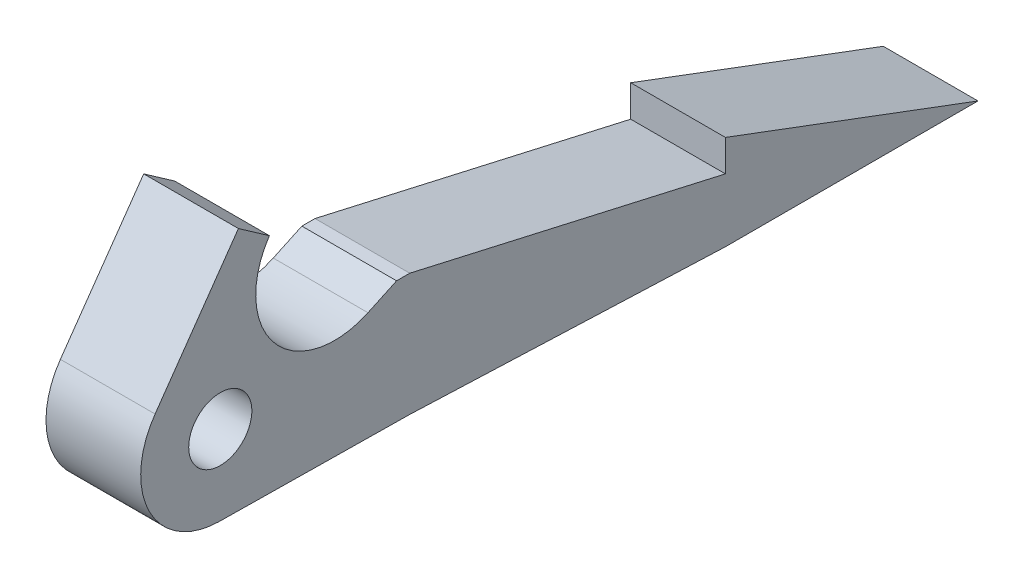
ISO-10303-21;
HEADER;
FILE_DESCRIPTION(('STEP AP214'),'2;1');
FILE_NAME('part.step','',(''),(''),'','','');
FILE_SCHEMA(('AUTOMOTIVE_DESIGN { 1 0 10303 214 1 1 1 1 }'));
ENDSEC;
DATA;
#1=APPLICATION_CONTEXT('core data for automotive mechanical design processes');
#2=APPLICATION_PROTOCOL_DEFINITION('international standard','automotive_design',2000,#1);
#3=PRODUCT_CONTEXT('',#1,'mechanical');
#4=PRODUCT('Part','Part','',(#3));
#5=PRODUCT_RELATED_PRODUCT_CATEGORY('part','',(#4));
#6=PRODUCT_DEFINITION_FORMATION('','',#4);
#7=PRODUCT_DEFINITION_CONTEXT('part definition',#1,'design');
#8=PRODUCT_DEFINITION('design','',#6,#7);
#9=PRODUCT_DEFINITION_SHAPE('','',#8);
#10=(LENGTH_UNIT() NAMED_UNIT(*) SI_UNIT(.MILLI.,.METRE.));
#11=(NAMED_UNIT(*) PLANE_ANGLE_UNIT() SI_UNIT($,.RADIAN.));
#12=(NAMED_UNIT(*) SI_UNIT($,.STERADIAN.) SOLID_ANGLE_UNIT());
#13=UNCERTAINTY_MEASURE_WITH_UNIT(LENGTH_MEASURE(1.E-05),#10,'distance_accuracy_value','');
#14=(GEOMETRIC_REPRESENTATION_CONTEXT(3) GLOBAL_UNCERTAINTY_ASSIGNED_CONTEXT((#13)) GLOBAL_UNIT_ASSIGNED_CONTEXT((#10,
#11,#12)) REPRESENTATION_CONTEXT('',''));
#15=CARTESIAN_POINT('',(0.,0.,0.));
#16=DIRECTION('',(0.,0.,1.));
#17=DIRECTION('',(1.,0.,0.));
#18=AXIS2_PLACEMENT_3D('',#15,#16,#17);
#19=CARTESIAN_POINT('',(4.7625,9.525,-176.47164647412));
#20=DIRECTION('',(1.,0.,0.));
#21=DIRECTION('',(0.,0.,-1.));
#22=AXIS2_PLACEMENT_3D('',#19,#20,#21);
#23=PLANE('',#22);
#24=CARTESIAN_POINT('',(4.7625,9.525,-176.47164647412));
#25=DIRECTION('',(1.,0.,0.));
#26=DIRECTION('',(0.,0.,-1.));
#27=AXIS2_PLACEMENT_3D('',#24,#25,#26);
#28=CIRCLE('',#27,8.001);
#29=CARTESIAN_POINT('',(4.7625,14.1141850672447,-169.917610967764));
#30=VERTEX_POINT('',#29);
#31=CARTESIAN_POINT('',(4.7625,1.52470715135464,-176.365272906379));
#32=VERTEX_POINT('',#31);
#33=EDGE_CURVE('E152',#30,#32,#28,.T.);
#34=ORIENTED_EDGE('',*,*,#33,.T.);
#35=DIRECTION('',(0.,-0.0132950340883751,-0.999911617128528));
#36=VECTOR('',#35,1.);
#37=CARTESIAN_POINT('',(4.7625,1.27000000001228,-195.521646474134));
#38=LINE('',#37,#36);
#39=CARTESIAN_POINT('',(4.7625,1.27000000001228,-195.521646474134));
#40=VERTEX_POINT('',#39);
#41=EDGE_CURVE('E99',#32,#40,#38,.T.);
#42=ORIENTED_EDGE('',*,*,#41,.T.);
#43=DIRECTION('',(0.,-0.0399680383492743,-0.999200958721773));
#44=VECTOR('',#43,1.);
#45=CARTESIAN_POINT('',(4.7625,0.,-227.27164647412));
#46=LINE('',#45,#44);
#47=CARTESIAN_POINT('',(4.7625,0.,-227.27164647412));
#48=VERTEX_POINT('',#47);
#49=EDGE_CURVE('E171',#40,#48,#46,.T.);
#50=ORIENTED_EDGE('',*,*,#49,.T.);
#51=DIRECTION('',(0.,0.,-1.));
#52=VECTOR('',#51,1.);
#53=CARTESIAN_POINT('',(4.7625,0.,-252.67164647412));
#54=LINE('',#53,#52);
#55=CARTESIAN_POINT('',(4.7625,0.,-252.67164647412));
#56=VERTEX_POINT('',#55);
#57=EDGE_CURVE('E273',#48,#56,#54,.T.);
#58=ORIENTED_EDGE('',*,*,#57,.T.);
#59=DIRECTION('',(0.,0.351123441588391,0.936329177569045));
#60=VECTOR('',#59,1.);
#61=CARTESIAN_POINT('',(4.7625,9.525,-227.27164647412));
#62=LINE('',#61,#60);
#63=CARTESIAN_POINT('',(4.7625,9.525,-227.27164647412));
#64=VERTEX_POINT('',#63);
#65=EDGE_CURVE('E276',#56,#64,#62,.T.);
#66=ORIENTED_EDGE('',*,*,#65,.T.);
#67=DIRECTION('',(0.,-1.,0.));
#68=VECTOR('',#67,1.);
#69=CARTESIAN_POINT('',(4.7625,6.35,-227.27164647412));
#70=LINE('',#69,#68);
#71=CARTESIAN_POINT('',(4.7625,6.35,-227.27164647412));
#72=VERTEX_POINT('',#71);
#73=EDGE_CURVE('E279',#64,#72,#70,.T.);
#74=ORIENTED_EDGE('',*,*,#73,.T.);
#75=DIRECTION('',(0.,0.22180272692565,0.975091559971855));
#76=VECTOR('',#75,1.);
#77=CARTESIAN_POINT('',(4.7625,13.5721285353887,-195.52164647412));
#78=LINE('',#77,#76);
#79=CARTESIAN_POINT('',(4.7625,13.5721285353885,-195.52164647412));
#80=VERTEX_POINT('',#79);
#81=EDGE_CURVE('E206',#72,#80,#78,.T.);
#82=ORIENTED_EDGE('',*,*,#81,.T.);
#83=DIRECTION('',(0.,1.55173966463147E-13,1.));
#84=VECTOR('',#83,1.);
#85=CARTESIAN_POINT('',(4.7625,13.5721285353887,-194.202498843684));
#86=LINE('',#85,#84);
#87=CARTESIAN_POINT('',(4.7625,13.5721285353887,-194.202498843684));
#88=VERTEX_POINT('',#87);
#89=EDGE_CURVE('E201',#80,#88,#86,.T.);
#90=ORIENTED_EDGE('',*,*,#89,.T.);
#91=DIRECTION('',(0.,-0.422618261740697,0.906307787036651));
#92=VECTOR('',#91,1.);
#93=CARTESIAN_POINT('',(4.7625,12.2303155543621,-191.324971619843));
#94=LINE('',#93,#92);
#95=CARTESIAN_POINT('',(4.7625,12.230315554362,-191.324971619843));
#96=VERTEX_POINT('',#95);
#97=EDGE_CURVE('E120',#88,#96,#94,.T.);
#98=ORIENTED_EDGE('',*,*,#97,.T.);
#99=CARTESIAN_POINT('',(4.7625,19.421926819351,-187.971468212505));
#100=DIRECTION('',(-1.,0.,0.));
#101=DIRECTION('',(0.,0.,-1.));
#102=AXIS2_PLACEMENT_3D('',#99,#100,#101);
#103=CIRCLE('',#102,7.93506507155085);
#104=CARTESIAN_POINT('',(4.7625,23.8925744515879,-181.415664109412));
#105=VERTEX_POINT('',#104);
#106=EDGE_CURVE('E114',#96,#105,#103,.T.);
#107=ORIENTED_EDGE('',*,*,#106,.T.);
#108=DIRECTION('',(0.,0.573576436351047,0.819152044288991));
#109=VECTOR('',#108,1.);
#110=CARTESIAN_POINT('',(4.7625,26.0779006740854,-178.294694820671));
#111=LINE('',#110,#109);
#112=CARTESIAN_POINT('',(4.7625,26.0779006740854,-178.294694820671));
#113=VERTEX_POINT('',#112);
#114=EDGE_CURVE('E118',#105,#113,#111,.T.);
#115=ORIENTED_EDGE('',*,*,#114,.T.);
#116=DIRECTION('',(0.,-0.819152044288992,0.573576436351046));
#117=VECTOR('',#116,1.);
#118=CARTESIAN_POINT('',(4.7625,14.1141850672447,-169.917610967764));
#119=LINE('',#118,#117);
#120=EDGE_CURVE('E58',#113,#30,#119,.T.);
#121=ORIENTED_EDGE('',*,*,#120,.T.);
#122=EDGE_LOOP('',(#34,#42,#50,#58,#66,#74,#82,#90,#98,#107,#115,#121));
#123=FACE_BOUND('',#122,.T.);
#124=CARTESIAN_POINT('',(4.7625,9.525,-176.47164647412));
#125=DIRECTION('',(1.,0.,0.));
#126=DIRECTION('',(0.,0.,-1.));
#127=AXIS2_PLACEMENT_3D('',#124,#125,#126);
#128=CIRCLE('',#127,3.17499999999995);
#129=CARTESIAN_POINT('',(4.7625,9.525,-173.296646474121));
#130=VERTEX_POINT('',#129);
#131=EDGE_CURVE('E142',#130,#130,#128,.T.);
#132=ORIENTED_EDGE('',*,*,#131,.F.);
#133=EDGE_LOOP('',(#132));
#134=FACE_BOUND('',#133,.T.);
#135=ADVANCED_FACE('F41',(#123,#134),#23,.T.);
#136=CARTESIAN_POINT('',(-4.7625,9.525,-176.47164647412));
#137=DIRECTION('',(1.,0.,0.));
#138=DIRECTION('',(0.,0.,-1.));
#139=AXIS2_PLACEMENT_3D('',#136,#137,#138);
#140=PLANE('',#139);
#141=CARTESIAN_POINT('',(-4.7625,9.525,-176.47164647412));
#142=DIRECTION('',(1.,0.,0.));
#143=DIRECTION('',(0.,0.,-1.));
#144=AXIS2_PLACEMENT_3D('',#141,#142,#143);
#145=CIRCLE('',#144,8.001);
#146=CARTESIAN_POINT('',(-4.7625,14.1141850672447,-169.917610967764));
#147=VERTEX_POINT('',#146);
#148=CARTESIAN_POINT('',(-4.7625,1.52470715135464,-176.365272906379));
#149=VERTEX_POINT('',#148);
#150=EDGE_CURVE('E138',#147,#149,#145,.T.);
#151=ORIENTED_EDGE('',*,*,#150,.F.);
#152=DIRECTION('',(0.,-0.819152044288992,0.573576436351046));
#153=VECTOR('',#152,1.);
#154=CARTESIAN_POINT('',(-4.7625,14.1141850672447,-169.917610967764));
#155=LINE('',#154,#153);
#156=CARTESIAN_POINT('',(-4.7625,26.0779006740854,-178.294694820671));
#157=VERTEX_POINT('',#156);
#158=EDGE_CURVE('E91',#157,#147,#155,.T.);
#159=ORIENTED_EDGE('',*,*,#158,.F.);
#160=DIRECTION('',(0.,0.573576436351047,0.819152044288991));
#161=VECTOR('',#160,1.);
#162=CARTESIAN_POINT('',(-4.7625,26.0779006740854,-178.294694820671));
#163=LINE('',#162,#161);
#164=CARTESIAN_POINT('',(-4.7625,23.8925744515879,-181.415664109412));
#165=VERTEX_POINT('',#164);
#166=EDGE_CURVE('E85',#165,#157,#163,.T.);
#167=ORIENTED_EDGE('',*,*,#166,.F.);
#168=CARTESIAN_POINT('',(-4.7625,19.421926819351,-187.971468212505));
#169=DIRECTION('',(-1.,0.,0.));
#170=DIRECTION('',(0.,0.,-1.));
#171=AXIS2_PLACEMENT_3D('',#168,#169,#170);
#172=CIRCLE('',#171,7.93506507155085);
#173=CARTESIAN_POINT('',(-4.7625,12.230315554362,-191.324971619843));
#174=VERTEX_POINT('',#173);
#175=EDGE_CURVE('E128',#174,#165,#172,.T.);
#176=ORIENTED_EDGE('',*,*,#175,.F.);
#177=DIRECTION('',(0.,-0.422618261740697,0.906307787036651));
#178=VECTOR('',#177,1.);
#179=CARTESIAN_POINT('',(-4.7625,12.2303155543621,-191.324971619843));
#180=LINE('',#179,#178);
#181=CARTESIAN_POINT('',(-4.7625,13.5721285353887,-194.202498843684));
#182=VERTEX_POINT('',#181);
#183=EDGE_CURVE('E147',#182,#174,#180,.T.);
#184=ORIENTED_EDGE('',*,*,#183,.F.);
#185=DIRECTION('',(0.,1.55173966463147E-13,1.));
#186=VECTOR('',#185,1.);
#187=CARTESIAN_POINT('',(-4.7625,13.5721285353887,-194.202498843684));
#188=LINE('',#187,#186);
#189=CARTESIAN_POINT('',(-4.7625,13.5721285353885,-195.52164647412));
#190=VERTEX_POINT('',#189);
#191=EDGE_CURVE('E145',#190,#182,#188,.T.);
#192=ORIENTED_EDGE('',*,*,#191,.F.);
#193=DIRECTION('',(0.,-0.22180272692565,-0.975091559971855));
#194=VECTOR('',#193,1.);
#195=CARTESIAN_POINT('',(-4.7625,13.5721285353887,-195.52164647412));
#196=LINE('',#195,#194);
#197=CARTESIAN_POINT('',(-4.7625,6.35,-227.27164647412));
#198=VERTEX_POINT('',#197);
#199=EDGE_CURVE('E186',#190,#198,#196,.T.);
#200=ORIENTED_EDGE('',*,*,#199,.T.);
#201=DIRECTION('',(0.,1.,0.));
#202=VECTOR('',#201,1.);
#203=CARTESIAN_POINT('',(-4.7625,6.35,-227.27164647412));
#204=LINE('',#203,#202);
#205=CARTESIAN_POINT('',(-4.7625,9.525,-227.27164647412));
#206=VERTEX_POINT('',#205);
#207=EDGE_CURVE('E191',#198,#206,#204,.T.);
#208=ORIENTED_EDGE('',*,*,#207,.T.);
#209=DIRECTION('',(0.,-0.351123441588391,-0.936329177569045));
#210=VECTOR('',#209,1.);
#211=CARTESIAN_POINT('',(-4.7625,9.525,-227.27164647412));
#212=LINE('',#211,#210);
#213=CARTESIAN_POINT('',(-4.7625,0.,-252.67164647412));
#214=VERTEX_POINT('',#213);
#215=EDGE_CURVE('E267',#206,#214,#212,.T.);
#216=ORIENTED_EDGE('',*,*,#215,.T.);
#217=DIRECTION('',(0.,0.,1.));
#218=VECTOR('',#217,1.);
#219=CARTESIAN_POINT('',(-4.7625,0.,-252.67164647412));
#220=LINE('',#219,#218);
#221=CARTESIAN_POINT('',(-4.7625,0.,-227.27164647412));
#222=VERTEX_POINT('',#221);
#223=EDGE_CURVE('E183',#214,#222,#220,.T.);
#224=ORIENTED_EDGE('',*,*,#223,.T.);
#225=DIRECTION('',(0.,0.0399680383492743,0.999200958721774));
#226=VECTOR('',#225,1.);
#227=CARTESIAN_POINT('',(-4.7625,0.,-227.27164647412));
#228=LINE('',#227,#226);
#229=CARTESIAN_POINT('',(-4.7625,1.27000000001228,-195.521646474134));
#230=VERTEX_POINT('',#229);
#231=EDGE_CURVE('E169',#222,#230,#228,.T.);
#232=ORIENTED_EDGE('',*,*,#231,.T.);
#233=DIRECTION('',(0.,-0.0132950340883751,-0.999911617128528));
#234=VECTOR('',#233,1.);
#235=CARTESIAN_POINT('',(-4.7625,1.27000000001228,-195.521646474134));
#236=LINE('',#235,#234);
#237=EDGE_CURVE('E141',#149,#230,#236,.T.);
#238=ORIENTED_EDGE('',*,*,#237,.F.);
#239=EDGE_LOOP('',(#151,#159,#167,#176,#184,#192,#200,#208,#216,#224,#232,#238));
#240=FACE_BOUND('',#239,.T.);
#241=CARTESIAN_POINT('',(-4.7625,9.525,-176.47164647412));
#242=DIRECTION('',(1.,0.,0.));
#243=DIRECTION('',(0.,0.,-1.));
#244=AXIS2_PLACEMENT_3D('',#241,#242,#243);
#245=CIRCLE('',#244,3.17499999999995);
#246=CARTESIAN_POINT('',(-4.7625,9.525,-173.296646474121));
#247=VERTEX_POINT('',#246);
#248=EDGE_CURVE('E185',#247,#247,#245,.T.);
#249=ORIENTED_EDGE('',*,*,#248,.T.);
#250=EDGE_LOOP('',(#249));
#251=FACE_BOUND('',#250,.T.);
#252=ADVANCED_FACE('F179',(#240,#251),#140,.F.);
#253=CARTESIAN_POINT('',(4.7625,9.525,-176.47164647412));
#254=DIRECTION('',(-1.,0.,0.));
#255=DIRECTION('',(0.,0.,1.));
#256=AXIS2_PLACEMENT_3D('',#253,#254,#255);
#257=CYLINDRICAL_SURFACE('',#256,8.001);
#258=ORIENTED_EDGE('',*,*,#150,.T.);
#259=DIRECTION('',(-1.,0.,0.));
#260=VECTOR('',#259,1.);
#261=CARTESIAN_POINT('',(4.7625,1.52470715135464,-176.365272906379));
#262=LINE('',#261,#260);
#263=EDGE_CURVE('E11',#32,#149,#262,.T.);
#264=ORIENTED_EDGE('',*,*,#263,.F.);
#265=ORIENTED_EDGE('',*,*,#33,.F.);
#266=DIRECTION('',(-1.,0.,0.));
#267=VECTOR('',#266,1.);
#268=CARTESIAN_POINT('',(4.7625,14.1141850672447,-169.917610967764));
#269=LINE('',#268,#267);
#270=EDGE_CURVE('E134',#30,#147,#269,.T.);
#271=ORIENTED_EDGE('',*,*,#270,.T.);
#272=EDGE_LOOP('',(#258,#264,#265,#271));
#273=FACE_BOUND('',#272,.T.);
#274=ADVANCED_FACE('F43',(#273),#257,.T.);
#275=CARTESIAN_POINT('',(4.7625,1.27000000001228,-195.521646474134));
#276=DIRECTION('',(0.,0.999911617128528,-0.0132950340883751));
#277=DIRECTION('',(0.,0.0132950340883751,0.999911617128529));
#278=AXIS2_PLACEMENT_3D('',#275,#276,#277);
#279=PLANE('',#278);
#280=ORIENTED_EDGE('',*,*,#237,.T.);
#281=DIRECTION('',(-1.,0.,0.));
#282=VECTOR('',#281,1.);
#283=CARTESIAN_POINT('',(4.7625,1.27000000001228,-195.521646474134));
#284=LINE('',#283,#282);
#285=EDGE_CURVE('E50',#40,#230,#284,.T.);
#286=ORIENTED_EDGE('',*,*,#285,.F.);
#287=ORIENTED_EDGE('',*,*,#41,.F.);
#288=ORIENTED_EDGE('',*,*,#263,.T.);
#289=EDGE_LOOP('',(#280,#286,#287,#288));
#290=FACE_BOUND('',#289,.T.);
#291=ADVANCED_FACE('F174',(#290),#279,.F.);
#292=CARTESIAN_POINT('',(4.7625,13.5721285353887,-194.202498843684));
#293=DIRECTION('',(0.,-1.,1.55173966463147E-13));
#294=DIRECTION('',(0.,-1.55173966463147E-13,-1.));
#295=AXIS2_PLACEMENT_3D('',#292,#293,#294);
#296=PLANE('',#295);
#297=ORIENTED_EDGE('',*,*,#191,.T.);
#298=DIRECTION('',(-1.,0.,0.));
#299=VECTOR('',#298,1.);
#300=CARTESIAN_POINT('',(4.7625,13.5721285353887,-194.202498843684));
#301=LINE('',#300,#299);
#302=EDGE_CURVE('E156',#88,#182,#301,.T.);
#303=ORIENTED_EDGE('',*,*,#302,.F.);
#304=ORIENTED_EDGE('',*,*,#89,.F.);
#305=DIRECTION('',(-1.,0.,0.));
#306=VECTOR('',#305,1.);
#307=CARTESIAN_POINT('',(4.7625,13.5721285353885,-195.52164647412));
#308=LINE('',#307,#306);
#309=EDGE_CURVE('E159',#80,#190,#308,.T.);
#310=ORIENTED_EDGE('',*,*,#309,.T.);
#311=EDGE_LOOP('',(#297,#303,#304,#310));
#312=FACE_BOUND('',#311,.T.);
#313=ADVANCED_FACE('F209',(#312),#296,.F.);
#314=CARTESIAN_POINT('',(4.7625,12.2303155543621,-191.324971619843));
#315=DIRECTION('',(0.,-0.906307787036651,-0.422618261740697));
#316=DIRECTION('',(0.,0.422618261740697,-0.906307787036651));
#317=AXIS2_PLACEMENT_3D('',#314,#315,#316);
#318=PLANE('',#317);
#319=ORIENTED_EDGE('',*,*,#183,.T.);
#320=DIRECTION('',(-1.,0.,0.));
#321=VECTOR('',#320,1.);
#322=CARTESIAN_POINT('',(4.7625,12.230315554362,-191.324971619843));
#323=LINE('',#322,#321);
#324=EDGE_CURVE('E129',#96,#174,#323,.T.);
#325=ORIENTED_EDGE('',*,*,#324,.F.);
#326=ORIENTED_EDGE('',*,*,#97,.F.);
#327=ORIENTED_EDGE('',*,*,#302,.T.);
#328=EDGE_LOOP('',(#319,#325,#326,#327));
#329=FACE_BOUND('',#328,.T.);
#330=ADVANCED_FACE('F213',(#329),#318,.F.);
#331=CARTESIAN_POINT('',(4.7625,19.421926819351,-187.971468212505));
#332=DIRECTION('',(-1.,0.,0.));
#333=DIRECTION('',(0.,0.,1.));
#334=AXIS2_PLACEMENT_3D('',#331,#332,#333);
#335=CYLINDRICAL_SURFACE('',#334,7.93506507155085);
#336=ORIENTED_EDGE('',*,*,#175,.T.);
#337=DIRECTION('',(-1.,0.,0.));
#338=VECTOR('',#337,1.);
#339=CARTESIAN_POINT('',(4.7625,23.8925744515879,-181.415664109412));
#340=LINE('',#339,#338);
#341=EDGE_CURVE('E125',#105,#165,#340,.T.);
#342=ORIENTED_EDGE('',*,*,#341,.F.);
#343=ORIENTED_EDGE('',*,*,#106,.F.);
#344=ORIENTED_EDGE('',*,*,#324,.T.);
#345=EDGE_LOOP('',(#336,#342,#343,#344));
#346=FACE_BOUND('',#345,.T.);
#347=ADVANCED_FACE('F126',(#346),#335,.F.);
#348=CARTESIAN_POINT('',(4.7625,26.0779006740854,-178.294694820671));
#349=DIRECTION('',(0.,-0.819152044288991,0.573576436351047));
#350=DIRECTION('',(0.,-0.573576436351047,-0.819152044288991));
#351=AXIS2_PLACEMENT_3D('',#348,#349,#350);
#352=PLANE('',#351);
#353=ORIENTED_EDGE('',*,*,#166,.T.);
#354=DIRECTION('',(-1.,0.,0.));
#355=VECTOR('',#354,1.);
#356=CARTESIAN_POINT('',(4.7625,26.0779006740854,-178.294694820671));
#357=LINE('',#356,#355);
#358=EDGE_CURVE('E130',#113,#157,#357,.T.);
#359=ORIENTED_EDGE('',*,*,#358,.F.);
#360=ORIENTED_EDGE('',*,*,#114,.F.);
#361=ORIENTED_EDGE('',*,*,#341,.T.);
#362=EDGE_LOOP('',(#353,#359,#360,#361));
#363=FACE_BOUND('',#362,.T.);
#364=ADVANCED_FACE('F132',(#363),#352,.F.);
#365=CARTESIAN_POINT('',(4.7625,14.1141850672447,-169.917610967764));
#366=DIRECTION('',(0.,-0.573576436351046,-0.819152044288992));
#367=DIRECTION('',(0.,0.819152044288992,-0.573576436351046));
#368=AXIS2_PLACEMENT_3D('',#365,#366,#367);
#369=PLANE('',#368);
#370=ORIENTED_EDGE('',*,*,#158,.T.);
#371=ORIENTED_EDGE('',*,*,#270,.F.);
#372=ORIENTED_EDGE('',*,*,#120,.F.);
#373=ORIENTED_EDGE('',*,*,#358,.T.);
#374=EDGE_LOOP('',(#370,#371,#372,#373));
#375=FACE_BOUND('',#374,.T.);
#376=ADVANCED_FACE('F216',(#375),#369,.F.);
#377=CARTESIAN_POINT('',(4.7625,9.525,-176.47164647412));
#378=DIRECTION('',(-1.,0.,0.));
#379=DIRECTION('',(0.,0.,1.));
#380=AXIS2_PLACEMENT_3D('',#377,#378,#379);
#381=CYLINDRICAL_SURFACE('',#380,3.17499999999995);
#382=CARTESIAN_POINT('',(4.7625,9.525,-173.296646474121));
#383=CARTESIAN_POINT('',(4.66328125,9.525,-173.296646474121));
#384=CARTESIAN_POINT('',(4.5640625,9.525,-173.296646474121));
#385=CARTESIAN_POINT('',(4.365625,9.525,-173.296646474121));
#386=CARTESIAN_POINT('',(4.26640625,9.525,-173.296646474121));
#387=CARTESIAN_POINT('',(4.06796875,9.525,-173.296646474121));
#388=CARTESIAN_POINT('',(3.96875,9.525,-173.296646474121));
#389=CARTESIAN_POINT('',(3.7703125,9.525,-173.296646474121));
#390=CARTESIAN_POINT('',(3.67109375,9.525,-173.296646474121));
#391=CARTESIAN_POINT('',(3.47265625,9.525,-173.296646474121));
#392=CARTESIAN_POINT('',(3.3734375,9.525,-173.296646474121));
#393=CARTESIAN_POINT('',(3.175,9.525,-173.296646474121));
#394=CARTESIAN_POINT('',(3.07578125,9.525,-173.296646474121));
#395=CARTESIAN_POINT('',(2.87734375,9.525,-173.296646474121));
#396=CARTESIAN_POINT('',(2.778125,9.525,-173.296646474121));
#397=CARTESIAN_POINT('',(2.5796875,9.525,-173.296646474121));
#398=CARTESIAN_POINT('',(2.48046875,9.525,-173.296646474121));
#399=CARTESIAN_POINT('',(2.28203125,9.525,-173.296646474121));
#400=CARTESIAN_POINT('',(2.1828125,9.525,-173.296646474121));
#401=CARTESIAN_POINT('',(1.984375,9.525,-173.296646474121));
#402=CARTESIAN_POINT('',(1.88515625,9.525,-173.296646474121));
#403=CARTESIAN_POINT('',(1.68671875,9.525,-173.296646474121));
#404=CARTESIAN_POINT('',(1.5875,9.525,-173.296646474121));
#405=CARTESIAN_POINT('',(1.3890625,9.525,-173.296646474121));
#406=CARTESIAN_POINT('',(1.28984375,9.525,-173.296646474121));
#407=CARTESIAN_POINT('',(1.09140625,9.525,-173.296646474121));
#408=CARTESIAN_POINT('',(0.992187499999999,9.525,-173.296646474121));
#409=CARTESIAN_POINT('',(0.79375,9.525,-173.296646474121));
#410=CARTESIAN_POINT('',(0.69453125,9.525,-173.296646474121));
#411=CARTESIAN_POINT('',(0.49609375,9.525,-173.296646474121));
#412=CARTESIAN_POINT('',(0.396875,9.525,-173.296646474121));
#413=CARTESIAN_POINT('',(0.1984375,9.525,-173.296646474121));
#414=CARTESIAN_POINT('',(0.0992187500000001,9.525,-173.296646474121));
#415=CARTESIAN_POINT('',(-0.0992187500000001,9.525,-173.296646474121));
#416=CARTESIAN_POINT('',(-0.1984375,9.525,-173.296646474121));
#417=CARTESIAN_POINT('',(-0.396875,9.525,-173.296646474121));
#418=CARTESIAN_POINT('',(-0.49609375,9.525,-173.296646474121));
#419=CARTESIAN_POINT('',(-0.69453125,9.525,-173.296646474121));
#420=CARTESIAN_POINT('',(-0.793750000000001,9.525,-173.296646474121));
#421=CARTESIAN_POINT('',(-0.992187500000001,9.525,-173.296646474121));
#422=CARTESIAN_POINT('',(-1.09140625,9.525,-173.296646474121));
#423=CARTESIAN_POINT('',(-1.28984375,9.525,-173.296646474121));
#424=CARTESIAN_POINT('',(-1.3890625,9.525,-173.296646474121));
#425=CARTESIAN_POINT('',(-1.5875,9.525,-173.296646474121));
#426=CARTESIAN_POINT('',(-1.68671875,9.525,-173.296646474121));
#427=CARTESIAN_POINT('',(-1.88515625,9.525,-173.296646474121));
#428=CARTESIAN_POINT('',(-1.984375,9.525,-173.296646474121));
#429=CARTESIAN_POINT('',(-2.1828125,9.525,-173.296646474121));
#430=CARTESIAN_POINT('',(-2.28203125,9.525,-173.296646474121));
#431=CARTESIAN_POINT('',(-2.48046875,9.525,-173.296646474121));
#432=CARTESIAN_POINT('',(-2.5796875,9.525,-173.296646474121));
#433=CARTESIAN_POINT('',(-2.778125,9.525,-173.296646474121));
#434=CARTESIAN_POINT('',(-2.87734375,9.525,-173.296646474121));
#435=CARTESIAN_POINT('',(-3.07578125,9.525,-173.296646474121));
#436=CARTESIAN_POINT('',(-3.175,9.525,-173.296646474121));
#437=CARTESIAN_POINT('',(-3.3734375,9.525,-173.296646474121));
#438=CARTESIAN_POINT('',(-3.47265625,9.525,-173.296646474121));
#439=CARTESIAN_POINT('',(-3.67109375,9.525,-173.296646474121));
#440=CARTESIAN_POINT('',(-3.7703125,9.525,-173.296646474121));
#441=CARTESIAN_POINT('',(-3.96875,9.525,-173.296646474121));
#442=CARTESIAN_POINT('',(-4.06796875,9.525,-173.296646474121));
#443=CARTESIAN_POINT('',(-4.26640625,9.525,-173.296646474121));
#444=CARTESIAN_POINT('',(-4.365625,9.525,-173.296646474121));
#445=CARTESIAN_POINT('',(-4.5640625,9.525,-173.296646474121));
#446=CARTESIAN_POINT('',(-4.66328125,9.525,-173.296646474121));
#447=CARTESIAN_POINT('',(-4.7625,9.525,-173.296646474121));
#448=B_SPLINE_CURVE_WITH_KNOTS('',3,(#382,#383,#384,#385,#386,#387,#388,#389,#390,#391,#392,
#393,#394,#395,#396,#397,#398,#399,#400,#401,#402,#403,#404,#405,#406,#407,#408,#409,#410,#411,
#412,#413,#414,#415,#416,#417,#418,#419,#420,#421,#422,#423,#424,#425,#426,#427,#428,#429,#430,
#431,#432,#433,#434,#435,#436,#437,#438,#439,#440,#441,#442,#443,#444,#445,#446,#447),
.UNSPECIFIED.,.F.,.F.,(4,2,2,2,2,2,2,2,2,2,2,2,2,2,2,2,2,2,2,2,2,2,2,2,2,2,2,2,2,2,2,2,4),(0.,
0.29765625,0.5953125,0.892968750000001,1.190625,1.48828125,1.7859375,2.08359375,2.38125,
2.67890625,2.9765625,3.27421875,3.571875,3.86953125,4.1671875,4.46484375,4.7625,5.06015625,
5.3578125,5.65546875,5.953125,6.25078125,6.5484375,6.84609375,7.14375,7.44140625,7.7390625,
8.03671875,8.334375,8.63203125,8.9296875,9.22734375,9.525),.UNSPECIFIED.);
#449=EDGE_CURVE('BSEAM218',#130,#247,#448,.T.);
#450=ORIENTED_EDGE('',*,*,#131,.T.);
#451=ORIENTED_EDGE('',*,*,#248,.F.);
#452=ORIENTED_EDGE('',*,*,#449,.T.);
#453=ORIENTED_EDGE('',*,*,#449,.F.);
#454=EDGE_LOOP('',(#450,#452,#451,#453));
#455=FACE_BOUND('',#454,.T.);
#456=ADVANCED_FACE('F218',(#455),#381,.F.);
#457=CARTESIAN_POINT('',(-63.5019686133702,13.5721285353887,-195.52164647412));
#458=DIRECTION('',(0.,0.975091559971855,-0.22180272692565));
#459=DIRECTION('',(0.,0.22180272692565,0.975091559971855));
#460=AXIS2_PLACEMENT_3D('',#457,#458,#459);
#461=PLANE('',#460);
#462=ORIENTED_EDGE('',*,*,#199,.F.);
#463=ORIENTED_EDGE('',*,*,#309,.F.);
#464=ORIENTED_EDGE('',*,*,#81,.F.);
#465=DIRECTION('',(1.,0.,0.));
#466=VECTOR('',#465,1.);
#467=CARTESIAN_POINT('',(-63.5019686133702,6.35,-227.27164647412));
#468=LINE('',#467,#466);
#469=EDGE_CURVE('E256',#198,#72,#468,.T.);
#470=ORIENTED_EDGE('',*,*,#469,.F.);
#471=EDGE_LOOP('',(#462,#463,#464,#470));
#472=FACE_BOUND('',#471,.T.);
#473=ADVANCED_FACE('F224',(#472),#461,.T.);
#474=CARTESIAN_POINT('',(-63.5019686133702,6.35,-227.27164647412));
#475=DIRECTION('',(0.,0.,1.));
#476=DIRECTION('',(1.,0.,0.));
#477=AXIS2_PLACEMENT_3D('',#474,#475,#476);
#478=PLANE('',#477);
#479=ORIENTED_EDGE('',*,*,#207,.F.);
#480=ORIENTED_EDGE('',*,*,#469,.T.);
#481=ORIENTED_EDGE('',*,*,#73,.F.);
#482=DIRECTION('',(1.,0.,0.));
#483=VECTOR('',#482,1.);
#484=CARTESIAN_POINT('',(-63.5019686133702,9.525,-227.27164647412));
#485=LINE('',#484,#483);
#486=EDGE_CURVE('E266',#206,#64,#485,.T.);
#487=ORIENTED_EDGE('',*,*,#486,.F.);
#488=EDGE_LOOP('',(#479,#480,#481,#487));
#489=FACE_BOUND('',#488,.T.);
#490=ADVANCED_FACE('F244',(#489),#478,.T.);
#491=CARTESIAN_POINT('',(-63.5019686133702,9.525,-227.27164647412));
#492=DIRECTION('',(0.,0.936329177569045,-0.351123441588391));
#493=DIRECTION('',(0.,0.351123441588391,0.936329177569045));
#494=AXIS2_PLACEMENT_3D('',#491,#492,#493);
#495=PLANE('',#494);
#496=ORIENTED_EDGE('',*,*,#215,.F.);
#497=ORIENTED_EDGE('',*,*,#486,.T.);
#498=ORIENTED_EDGE('',*,*,#65,.F.);
#499=DIRECTION('',(1.,0.,0.));
#500=VECTOR('',#499,1.);
#501=CARTESIAN_POINT('',(-63.5019686133702,0.,-252.67164647412));
#502=LINE('',#501,#500);
#503=EDGE_CURVE('E283',#214,#56,#502,.T.);
#504=ORIENTED_EDGE('',*,*,#503,.F.);
#505=EDGE_LOOP('',(#496,#497,#498,#504));
#506=FACE_BOUND('',#505,.T.);
#507=ADVANCED_FACE('F240',(#506),#495,.T.);
#508=CARTESIAN_POINT('',(-63.5019686133702,0.,-252.67164647412));
#509=DIRECTION('',(0.,-1.,0.));
#510=DIRECTION('',(0.,0.,-1.));
#511=AXIS2_PLACEMENT_3D('',#508,#509,#510);
#512=PLANE('',#511);
#513=ORIENTED_EDGE('',*,*,#223,.F.);
#514=ORIENTED_EDGE('',*,*,#503,.T.);
#515=ORIENTED_EDGE('',*,*,#57,.F.);
#516=DIRECTION('',(1.,0.,0.));
#517=VECTOR('',#516,1.);
#518=CARTESIAN_POINT('',(-63.5019686133702,0.,-227.27164647412));
#519=LINE('',#518,#517);
#520=EDGE_CURVE('E195',#222,#48,#519,.T.);
#521=ORIENTED_EDGE('',*,*,#520,.F.);
#522=EDGE_LOOP('',(#513,#514,#515,#521));
#523=FACE_BOUND('',#522,.T.);
#524=ADVANCED_FACE('F237',(#523),#512,.T.);
#525=CARTESIAN_POINT('',(-63.5019686133702,0.,-227.27164647412));
#526=DIRECTION('',(0.,-0.999200958721773,0.0399680383492743));
#527=DIRECTION('',(0.,-0.0399680383492743,-0.999200958721774));
#528=AXIS2_PLACEMENT_3D('',#525,#526,#527);
#529=PLANE('',#528);
#530=ORIENTED_EDGE('',*,*,#231,.F.);
#531=ORIENTED_EDGE('',*,*,#520,.T.);
#532=ORIENTED_EDGE('',*,*,#49,.F.);
#533=ORIENTED_EDGE('',*,*,#285,.T.);
#534=EDGE_LOOP('',(#530,#531,#532,#533));
#535=FACE_BOUND('',#534,.T.);
#536=ADVANCED_FACE('F165',(#535),#529,.T.);
#537=CLOSED_SHELL('',(#135,#252,#274,#291,#313,#330,#347,#364,#376,#456,#473,#490,#507,#524,#536));
#538=MANIFOLD_SOLID_BREP('B2',#537);
#539=ADVANCED_BREP_SHAPE_REPRESENTATION('',(#18,#538),#14);
#540=SHAPE_DEFINITION_REPRESENTATION(#9,#539);
ENDSEC;
END-ISO-10303-21;
